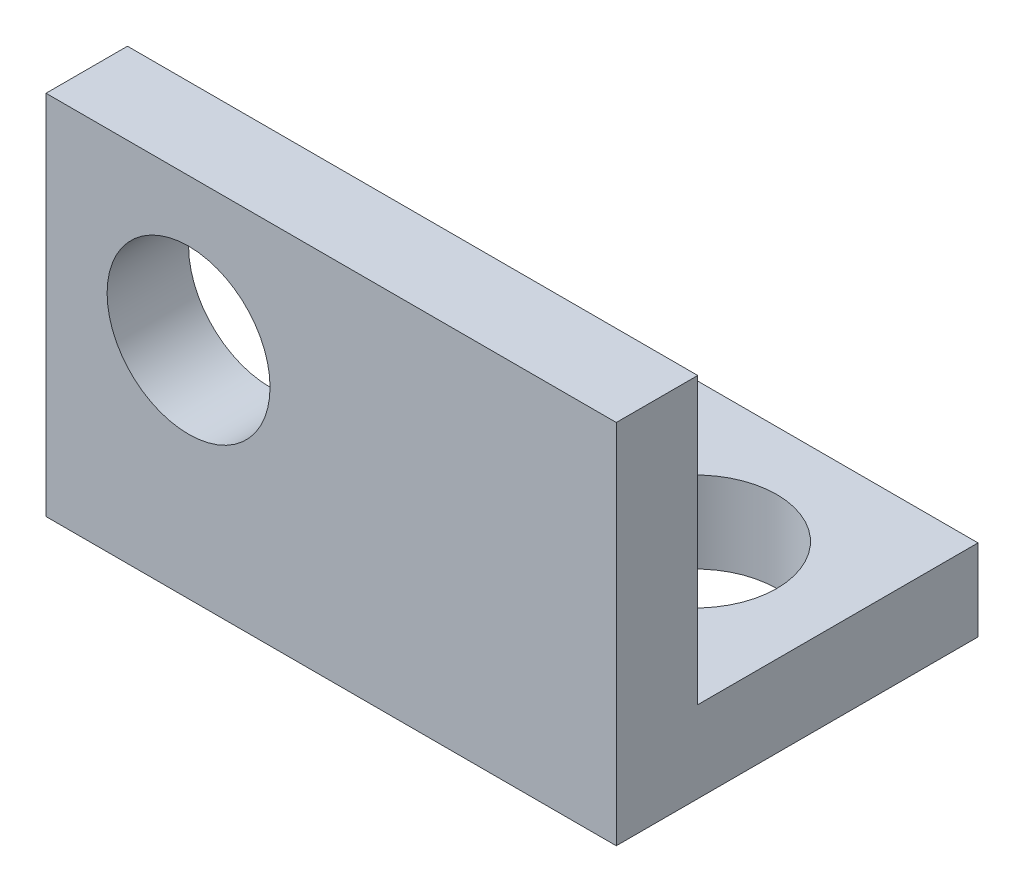
ISO-10303-21;
HEADER;
FILE_DESCRIPTION(('STEP AP214'),'2;1');
FILE_NAME('part.step','',(''),(''),'','','');
FILE_SCHEMA(('AUTOMOTIVE_DESIGN { 1 0 10303 214 1 1 1 1 }'));
ENDSEC;
DATA;
#1=APPLICATION_CONTEXT('core data for automotive mechanical design processes');
#2=APPLICATION_PROTOCOL_DEFINITION('international standard','automotive_design',2000,#1);
#3=PRODUCT_CONTEXT('',#1,'mechanical');
#4=PRODUCT('Part','Part','',(#3));
#5=PRODUCT_RELATED_PRODUCT_CATEGORY('part','',(#4));
#6=PRODUCT_DEFINITION_FORMATION('','',#4);
#7=PRODUCT_DEFINITION_CONTEXT('part definition',#1,'design');
#8=PRODUCT_DEFINITION('design','',#6,#7);
#9=PRODUCT_DEFINITION_SHAPE('','',#8);
#10=(LENGTH_UNIT() NAMED_UNIT(*) SI_UNIT(.MILLI.,.METRE.));
#11=(NAMED_UNIT(*) PLANE_ANGLE_UNIT() SI_UNIT($,.RADIAN.));
#12=(NAMED_UNIT(*) SI_UNIT($,.STERADIAN.) SOLID_ANGLE_UNIT());
#13=UNCERTAINTY_MEASURE_WITH_UNIT(LENGTH_MEASURE(1.E-05),#10,'distance_accuracy_value','');
#14=(GEOMETRIC_REPRESENTATION_CONTEXT(3) GLOBAL_UNCERTAINTY_ASSIGNED_CONTEXT((#13)) GLOBAL_UNIT_ASSIGNED_CONTEXT((#10,
#11,#12)) REPRESENTATION_CONTEXT('',''));
#15=CARTESIAN_POINT('',(0.,0.,0.));
#16=DIRECTION('',(0.,0.,1.));
#17=DIRECTION('',(1.,0.,0.));
#18=AXIS2_PLACEMENT_3D('',#15,#16,#17);
#19=CARTESIAN_POINT('',(0.,2.54,0.));
#20=DIRECTION('',(0.,-1.,0.));
#21=DIRECTION('',(0.,0.,-1.));
#22=AXIS2_PLACEMENT_3D('',#19,#20,#21);
#23=PLANE('',#22);
#24=CARTESIAN_POINT('',(-4.445,2.54,4.3688));
#25=DIRECTION('',(0.,1.,0.));
#26=DIRECTION('',(0.,0.,1.));
#27=AXIS2_PLACEMENT_3D('',#24,#25,#26);
#28=CIRCLE('',#27,2.54);
#29=CARTESIAN_POINT('',(-4.445,2.54,6.9088));
#30=VERTEX_POINT('',#29);
#31=EDGE_CURVE('E103',#30,#30,#28,.T.);
#32=ORIENTED_EDGE('',*,*,#31,.F.);
#33=EDGE_LOOP('',(#32));
#34=FACE_BOUND('',#33,.T.);
#35=DIRECTION('',(-1.,0.,0.));
#36=VECTOR('',#35,1.);
#37=CARTESIAN_POINT('',(0.,2.54,8.7376));
#38=LINE('',#37,#36);
#39=CARTESIAN_POINT('',(0.,2.54,8.7376));
#40=VERTEX_POINT('',#39);
#41=CARTESIAN_POINT('',(-8.89,2.54,8.7376));
#42=VERTEX_POINT('',#41);
#43=EDGE_CURVE('E126',#40,#42,#38,.T.);
#44=ORIENTED_EDGE('',*,*,#43,.F.);
#45=DIRECTION('',(0.,0.,-1.));
#46=VECTOR('',#45,1.);
#47=CARTESIAN_POINT('',(0.,2.54,0.));
#48=LINE('',#47,#46);
#49=CARTESIAN_POINT('',(0.,2.54,0.));
#50=VERTEX_POINT('',#49);
#51=EDGE_CURVE('E86',#40,#50,#48,.T.);
#52=ORIENTED_EDGE('',*,*,#51,.T.);
#53=DIRECTION('',(-1.,0.,0.));
#54=VECTOR('',#53,1.);
#55=CARTESIAN_POINT('',(0.,2.54,0.));
#56=LINE('',#55,#54);
#57=CARTESIAN_POINT('',(-8.89,2.54,0.));
#58=VERTEX_POINT('',#57);
#59=EDGE_CURVE('E51',#50,#58,#56,.T.);
#60=ORIENTED_EDGE('',*,*,#59,.T.);
#61=DIRECTION('',(0.,0.,1.));
#62=VECTOR('',#61,1.);
#63=CARTESIAN_POINT('',(-8.89,2.54,0.));
#64=LINE('',#63,#62);
#65=EDGE_CURVE('E97',#58,#42,#64,.T.);
#66=ORIENTED_EDGE('',*,*,#65,.T.);
#67=EDGE_LOOP('',(#44,#52,#60,#66));
#68=FACE_BOUND('',#67,.T.);
#69=ADVANCED_FACE('F34',(#34,#68),#23,.F.);
#70=CARTESIAN_POINT('',(-8.89,2.54,0.));
#71=DIRECTION('',(1.,0.,0.));
#72=DIRECTION('',(0.,0.,-1.));
#73=AXIS2_PLACEMENT_3D('',#70,#71,#72);
#74=PLANE('',#73);
#75=DIRECTION('',(0.,-1.,0.));
#76=VECTOR('',#75,1.);
#77=CARTESIAN_POINT('',(-8.89,2.54,8.7376));
#78=LINE('',#77,#76);
#79=CARTESIAN_POINT('',(-8.89,0.,8.7376));
#80=VERTEX_POINT('',#79);
#81=EDGE_CURVE('E11',#42,#80,#78,.T.);
#82=ORIENTED_EDGE('',*,*,#81,.F.);
#83=ORIENTED_EDGE('',*,*,#65,.F.);
#84=DIRECTION('',(0.,-1.,0.));
#85=VECTOR('',#84,1.);
#86=CARTESIAN_POINT('',(-8.89,2.54,0.));
#87=LINE('',#86,#85);
#88=CARTESIAN_POINT('',(-8.89,0.,0.));
#89=VERTEX_POINT('',#88);
#90=EDGE_CURVE('E96',#58,#89,#87,.T.);
#91=ORIENTED_EDGE('',*,*,#90,.T.);
#92=DIRECTION('',(0.,0.,1.));
#93=VECTOR('',#92,1.);
#94=CARTESIAN_POINT('',(-8.89,0.,0.));
#95=LINE('',#94,#93);
#96=EDGE_CURVE('E87',#89,#80,#95,.T.);
#97=ORIENTED_EDGE('',*,*,#96,.T.);
#98=EDGE_LOOP('',(#82,#83,#91,#97));
#99=FACE_BOUND('',#98,.T.);
#100=ADVANCED_FACE('F176',(#99),#74,.F.);
#101=CARTESIAN_POINT('',(0.,0.,0.));
#102=DIRECTION('',(0.,-1.,0.));
#103=DIRECTION('',(0.,0.,-1.));
#104=AXIS2_PLACEMENT_3D('',#101,#102,#103);
#105=PLANE('',#104);
#106=DIRECTION('',(1.,0.,0.));
#107=VECTOR('',#106,1.);
#108=CARTESIAN_POINT('',(0.,0.,8.7376));
#109=LINE('',#108,#107);
#110=CARTESIAN_POINT('',(-17.78,0.,8.7376));
#111=VERTEX_POINT('',#110);
#112=EDGE_CURVE('E133',#111,#80,#109,.T.);
#113=ORIENTED_EDGE('',*,*,#112,.T.);
#114=ORIENTED_EDGE('',*,*,#96,.F.);
#115=DIRECTION('',(-1.,0.,0.));
#116=VECTOR('',#115,1.);
#117=CARTESIAN_POINT('',(0.,0.,0.));
#118=LINE('',#117,#116);
#119=CARTESIAN_POINT('',(0.,0.,0.));
#120=VERTEX_POINT('',#119);
#121=EDGE_CURVE('E64',#120,#89,#118,.T.);
#122=ORIENTED_EDGE('',*,*,#121,.F.);
#123=DIRECTION('',(0.,0.,-1.));
#124=VECTOR('',#123,1.);
#125=CARTESIAN_POINT('',(0.,0.,0.));
#126=LINE('',#125,#124);
#127=CARTESIAN_POINT('',(0.,0.,11.2776));
#128=VERTEX_POINT('',#127);
#129=EDGE_CURVE('E91',#128,#120,#126,.T.);
#130=ORIENTED_EDGE('',*,*,#129,.F.);
#131=DIRECTION('',(1.,0.,0.));
#132=VECTOR('',#131,1.);
#133=CARTESIAN_POINT('',(0.,0.,11.2776));
#134=LINE('',#133,#132);
#135=CARTESIAN_POINT('',(-17.78,0.,11.2776));
#136=VERTEX_POINT('',#135);
#137=EDGE_CURVE('E71',#136,#128,#134,.T.);
#138=ORIENTED_EDGE('',*,*,#137,.F.);
#139=DIRECTION('',(0.,0.,1.));
#140=VECTOR('',#139,1.);
#141=CARTESIAN_POINT('',(-17.78,0.,8.7376));
#142=LINE('',#141,#140);
#143=EDGE_CURVE('E130',#111,#136,#142,.T.);
#144=ORIENTED_EDGE('',*,*,#143,.F.);
#145=EDGE_LOOP('',(#113,#114,#122,#130,#138,#144));
#146=FACE_BOUND('',#145,.T.);
#147=CARTESIAN_POINT('',(-4.445,0.,4.3688));
#148=DIRECTION('',(0.,1.,0.));
#149=DIRECTION('',(0.,0.,1.));
#150=AXIS2_PLACEMENT_3D('',#147,#148,#149);
#151=CIRCLE('',#150,2.54);
#152=CARTESIAN_POINT('',(-4.445,0.,6.9088));
#153=VERTEX_POINT('',#152);
#154=EDGE_CURVE('E107',#153,#153,#151,.T.);
#155=ORIENTED_EDGE('',*,*,#154,.T.);
#156=EDGE_LOOP('',(#155));
#157=FACE_BOUND('',#156,.T.);
#158=ADVANCED_FACE('F100',(#146,#157),#105,.T.);
#159=CARTESIAN_POINT('',(0.,2.54,0.));
#160=DIRECTION('',(-1.,0.,0.));
#161=DIRECTION('',(0.,0.,1.));
#162=AXIS2_PLACEMENT_3D('',#159,#160,#161);
#163=PLANE('',#162);
#164=ORIENTED_EDGE('',*,*,#129,.T.);
#165=DIRECTION('',(0.,-1.,0.));
#166=VECTOR('',#165,1.);
#167=CARTESIAN_POINT('',(0.,2.54,0.));
#168=LINE('',#167,#166);
#169=EDGE_CURVE('E43',#50,#120,#168,.T.);
#170=ORIENTED_EDGE('',*,*,#169,.F.);
#171=ORIENTED_EDGE('',*,*,#51,.F.);
#172=DIRECTION('',(0.,1.,0.));
#173=VECTOR('',#172,1.);
#174=CARTESIAN_POINT('',(0.,0.,8.7376));
#175=LINE('',#174,#173);
#176=CARTESIAN_POINT('',(0.,11.43,8.7376));
#177=VERTEX_POINT('',#176);
#178=EDGE_CURVE('E119',#40,#177,#175,.T.);
#179=ORIENTED_EDGE('',*,*,#178,.T.);
#180=DIRECTION('',(0.,0.,1.));
#181=VECTOR('',#180,1.);
#182=CARTESIAN_POINT('',(0.,11.43,8.7376));
#183=LINE('',#182,#181);
#184=CARTESIAN_POINT('',(0.,11.43,11.2776));
#185=VERTEX_POINT('',#184);
#186=EDGE_CURVE('E94',#177,#185,#183,.T.);
#187=ORIENTED_EDGE('',*,*,#186,.T.);
#188=DIRECTION('',(0.,-1.,0.));
#189=VECTOR('',#188,1.);
#190=CARTESIAN_POINT('',(0.,2.54,11.2776));
#191=LINE('',#190,#189);
#192=EDGE_CURVE('E77',#185,#128,#191,.T.);
#193=ORIENTED_EDGE('',*,*,#192,.T.);
#194=EDGE_LOOP('',(#164,#170,#171,#179,#187,#193));
#195=FACE_BOUND('',#194,.T.);
#196=ADVANCED_FACE('F36',(#195),#163,.F.);
#197=CARTESIAN_POINT('',(0.,2.54,0.));
#198=DIRECTION('',(0.,0.,1.));
#199=DIRECTION('',(1.,0.,0.));
#200=AXIS2_PLACEMENT_3D('',#197,#198,#199);
#201=PLANE('',#200);
#202=ORIENTED_EDGE('',*,*,#121,.T.);
#203=ORIENTED_EDGE('',*,*,#90,.F.);
#204=ORIENTED_EDGE('',*,*,#59,.F.);
#205=ORIENTED_EDGE('',*,*,#169,.T.);
#206=EDGE_LOOP('',(#202,#203,#204,#205));
#207=FACE_BOUND('',#206,.T.);
#208=ADVANCED_FACE('F114',(#207),#201,.F.);
#209=CARTESIAN_POINT('',(0.,2.54,11.2776));
#210=DIRECTION('',(0.,0.,-1.));
#211=DIRECTION('',(-1.,0.,0.));
#212=AXIS2_PLACEMENT_3D('',#209,#210,#211);
#213=PLANE('',#212);
#214=ORIENTED_EDGE('',*,*,#192,.F.);
#215=DIRECTION('',(-1.,0.,0.));
#216=VECTOR('',#215,1.);
#217=CARTESIAN_POINT('',(0.,11.43,11.2776));
#218=LINE('',#217,#216);
#219=CARTESIAN_POINT('',(-17.78,11.43,11.2776));
#220=VERTEX_POINT('',#219);
#221=EDGE_CURVE('E138',#185,#220,#218,.T.);
#222=ORIENTED_EDGE('',*,*,#221,.T.);
#223=DIRECTION('',(0.,-1.,0.));
#224=VECTOR('',#223,1.);
#225=CARTESIAN_POINT('',(-17.78,0.,11.2776));
#226=LINE('',#225,#224);
#227=EDGE_CURVE('E81',#220,#136,#226,.T.);
#228=ORIENTED_EDGE('',*,*,#227,.T.);
#229=ORIENTED_EDGE('',*,*,#137,.T.);
#230=EDGE_LOOP('',(#214,#222,#228,#229));
#231=FACE_BOUND('',#230,.T.);
#232=CARTESIAN_POINT('',(-13.335,6.985,11.2776));
#233=DIRECTION('',(0.,0.,1.));
#234=DIRECTION('',(1.,0.,0.));
#235=AXIS2_PLACEMENT_3D('',#232,#233,#234);
#236=CIRCLE('',#235,2.54);
#237=CARTESIAN_POINT('',(-10.795,6.985,11.2776));
#238=VERTEX_POINT('',#237);
#239=EDGE_CURVE('E149',#238,#238,#236,.T.);
#240=ORIENTED_EDGE('',*,*,#239,.F.);
#241=EDGE_LOOP('',(#240));
#242=FACE_BOUND('',#241,.T.);
#243=ADVANCED_FACE('F73',(#231,#242),#213,.F.);
#244=CARTESIAN_POINT('',(-4.445,2.54,4.3688));
#245=DIRECTION('',(0.,-1.,0.));
#246=DIRECTION('',(0.,0.,-1.));
#247=AXIS2_PLACEMENT_3D('',#244,#245,#246);
#248=CYLINDRICAL_SURFACE('',#247,2.54);
#249=ORIENTED_EDGE('',*,*,#31,.T.);
#250=EDGE_LOOP('',(#249));
#251=FACE_BOUND('',#250,.T.);
#252=ORIENTED_EDGE('',*,*,#154,.F.);
#253=EDGE_LOOP('',(#252));
#254=FACE_BOUND('',#253,.T.);
#255=ADVANCED_FACE('F165',(#251,#254),#248,.F.);
#256=CARTESIAN_POINT('',(0.,0.,8.7376));
#257=DIRECTION('',(0.,0.,1.));
#258=DIRECTION('',(1.,0.,0.));
#259=AXIS2_PLACEMENT_3D('',#256,#257,#258);
#260=PLANE('',#259);
#261=CARTESIAN_POINT('',(-13.335,6.985,8.7376));
#262=DIRECTION('',(0.,0.,1.));
#263=DIRECTION('',(1.,0.,0.));
#264=AXIS2_PLACEMENT_3D('',#261,#262,#263);
#265=CIRCLE('',#264,2.54);
#266=CARTESIAN_POINT('',(-10.795,6.985,8.7376));
#267=VERTEX_POINT('',#266);
#268=EDGE_CURVE('E140',#267,#267,#265,.T.);
#269=ORIENTED_EDGE('',*,*,#268,.T.);
#270=EDGE_LOOP('',(#269));
#271=FACE_BOUND('',#270,.T.);
#272=ORIENTED_EDGE('',*,*,#178,.F.);
#273=ORIENTED_EDGE('',*,*,#43,.T.);
#274=ORIENTED_EDGE('',*,*,#81,.T.);
#275=ORIENTED_EDGE('',*,*,#112,.F.);
#276=DIRECTION('',(0.,-1.,0.));
#277=VECTOR('',#276,1.);
#278=CARTESIAN_POINT('',(-17.78,0.,8.7376));
#279=LINE('',#278,#277);
#280=CARTESIAN_POINT('',(-17.78,11.43,8.7376));
#281=VERTEX_POINT('',#280);
#282=EDGE_CURVE('E142',#281,#111,#279,.T.);
#283=ORIENTED_EDGE('',*,*,#282,.F.);
#284=DIRECTION('',(-1.,0.,0.));
#285=VECTOR('',#284,1.);
#286=CARTESIAN_POINT('',(0.,11.43,8.7376));
#287=LINE('',#286,#285);
#288=EDGE_CURVE('E145',#177,#281,#287,.T.);
#289=ORIENTED_EDGE('',*,*,#288,.F.);
#290=EDGE_LOOP('',(#272,#273,#274,#275,#283,#289));
#291=FACE_BOUND('',#290,.T.);
#292=ADVANCED_FACE('F155',(#271,#291),#260,.F.);
#293=CARTESIAN_POINT('',(-17.78,0.,8.7376));
#294=DIRECTION('',(-1.,0.,0.));
#295=DIRECTION('',(0.,0.,1.));
#296=AXIS2_PLACEMENT_3D('',#293,#294,#295);
#297=PLANE('',#296);
#298=ORIENTED_EDGE('',*,*,#227,.F.);
#299=DIRECTION('',(0.,0.,1.));
#300=VECTOR('',#299,1.);
#301=CARTESIAN_POINT('',(-17.78,11.43,8.7376));
#302=LINE('',#301,#300);
#303=EDGE_CURVE('E132',#281,#220,#302,.T.);
#304=ORIENTED_EDGE('',*,*,#303,.F.);
#305=ORIENTED_EDGE('',*,*,#282,.T.);
#306=ORIENTED_EDGE('',*,*,#143,.T.);
#307=EDGE_LOOP('',(#298,#304,#305,#306));
#308=FACE_BOUND('',#307,.T.);
#309=ADVANCED_FACE('F240',(#308),#297,.T.);
#310=CARTESIAN_POINT('',(0.,11.43,8.7376));
#311=DIRECTION('',(0.,1.,0.));
#312=DIRECTION('',(-1.,0.,0.));
#313=AXIS2_PLACEMENT_3D('',#310,#311,#312);
#314=PLANE('',#313);
#315=ORIENTED_EDGE('',*,*,#221,.F.);
#316=ORIENTED_EDGE('',*,*,#186,.F.);
#317=ORIENTED_EDGE('',*,*,#288,.T.);
#318=ORIENTED_EDGE('',*,*,#303,.T.);
#319=EDGE_LOOP('',(#315,#316,#317,#318));
#320=FACE_BOUND('',#319,.T.);
#321=ADVANCED_FACE('F161',(#320),#314,.T.);
#322=CARTESIAN_POINT('',(-13.335,6.985,8.7376));
#323=DIRECTION('',(0.,0.,1.));
#324=DIRECTION('',(1.,0.,0.));
#325=AXIS2_PLACEMENT_3D('',#322,#323,#324);
#326=CYLINDRICAL_SURFACE('',#325,2.54);
#327=ORIENTED_EDGE('',*,*,#268,.F.);
#328=EDGE_LOOP('',(#327));
#329=FACE_BOUND('',#328,.T.);
#330=ORIENTED_EDGE('',*,*,#239,.T.);
#331=EDGE_LOOP('',(#330));
#332=FACE_BOUND('',#331,.T.);
#333=ADVANCED_FACE('F158',(#329,#332),#326,.F.);
#334=CLOSED_SHELL('',(#69,#100,#158,#196,#208,#243,#255,#292,#309,#321,#333));
#335=MANIFOLD_SOLID_BREP('B2',#334);
#336=ADVANCED_BREP_SHAPE_REPRESENTATION('',(#18,#335),#14);
#337=SHAPE_DEFINITION_REPRESENTATION(#9,#336);
ENDSEC;
END-ISO-10303-21;
